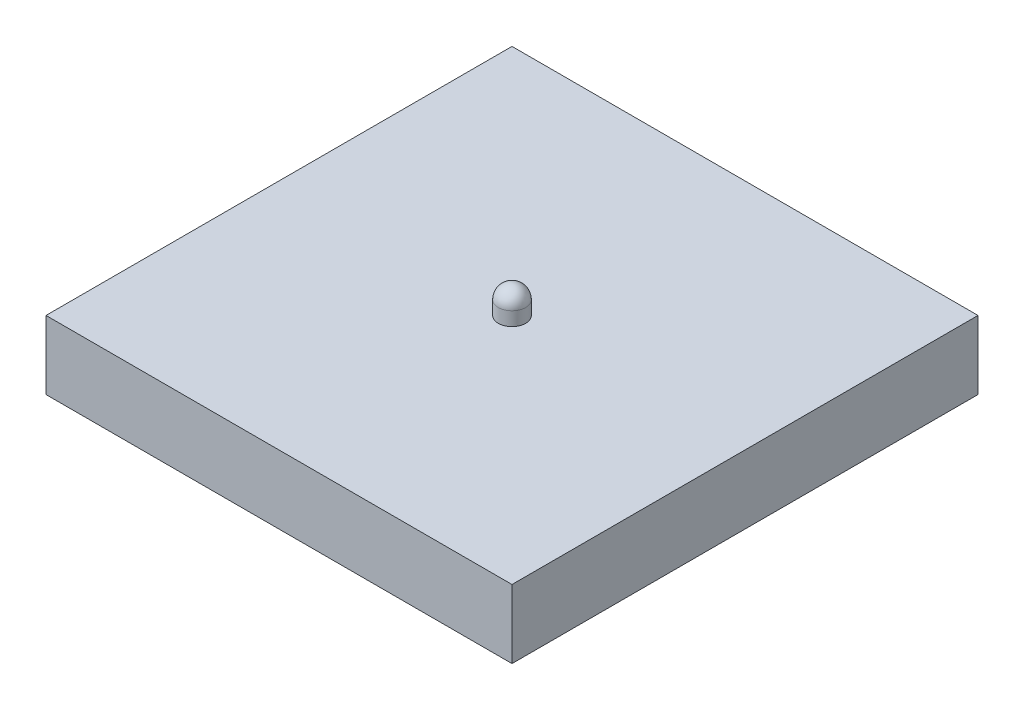
ISO-10303-21;
HEADER;
FILE_DESCRIPTION(('STEP AP214'),'2;1');
FILE_NAME('part.step','',(''),(''),'','','');
FILE_SCHEMA(('AUTOMOTIVE_DESIGN { 1 0 10303 214 1 1 1 1 }'));
ENDSEC;
DATA;
#1=APPLICATION_CONTEXT('core data for automotive mechanical design processes');
#2=APPLICATION_PROTOCOL_DEFINITION('international standard','automotive_design',2000,#1);
#3=PRODUCT_CONTEXT('',#1,'mechanical');
#4=PRODUCT('Part','Part','',(#3));
#5=PRODUCT_RELATED_PRODUCT_CATEGORY('part','',(#4));
#6=PRODUCT_DEFINITION_FORMATION('','',#4);
#7=PRODUCT_DEFINITION_CONTEXT('part definition',#1,'design');
#8=PRODUCT_DEFINITION('design','',#6,#7);
#9=PRODUCT_DEFINITION_SHAPE('','',#8);
#10=(LENGTH_UNIT() NAMED_UNIT(*) SI_UNIT(.MILLI.,.METRE.));
#11=(NAMED_UNIT(*) PLANE_ANGLE_UNIT() SI_UNIT($,.RADIAN.));
#12=(NAMED_UNIT(*) SI_UNIT($,.STERADIAN.) SOLID_ANGLE_UNIT());
#13=UNCERTAINTY_MEASURE_WITH_UNIT(LENGTH_MEASURE(1.E-05),#10,'distance_accuracy_value','');
#14=(GEOMETRIC_REPRESENTATION_CONTEXT(3) GLOBAL_UNCERTAINTY_ASSIGNED_CONTEXT((#13)) GLOBAL_UNIT_ASSIGNED_CONTEXT((#10,
#11,#12)) REPRESENTATION_CONTEXT('',''));
#15=CARTESIAN_POINT('',(0.,0.,0.));
#16=DIRECTION('',(0.,0.,1.));
#17=DIRECTION('',(1.,0.,0.));
#18=AXIS2_PLACEMENT_3D('',#15,#16,#17);
#19=CARTESIAN_POINT('',(17.,5.,17.));
#20=DIRECTION('',(-1.,0.,0.));
#21=DIRECTION('',(0.,0.,1.));
#22=AXIS2_PLACEMENT_3D('',#19,#20,#21);
#23=PLANE('',#22);
#24=DIRECTION('',(0.,0.,-1.));
#25=VECTOR('',#24,1.);
#26=CARTESIAN_POINT('',(17.,0.,17.));
#27=LINE('',#26,#25);
#28=CARTESIAN_POINT('',(17.,0.,17.));
#29=VERTEX_POINT('',#28);
#30=CARTESIAN_POINT('',(17.,0.,-17.));
#31=VERTEX_POINT('',#30);
#32=EDGE_CURVE('E143',#29,#31,#27,.T.);
#33=ORIENTED_EDGE('',*,*,#32,.T.);
#34=DIRECTION('',(0.,-1.,0.));
#35=VECTOR('',#34,1.);
#36=CARTESIAN_POINT('',(17.,5.,-17.));
#37=LINE('',#36,#35);
#38=CARTESIAN_POINT('',(17.,5.,-17.));
#39=VERTEX_POINT('',#38);
#40=EDGE_CURVE('E167',#39,#31,#37,.T.);
#41=ORIENTED_EDGE('',*,*,#40,.F.);
#42=DIRECTION('',(0.,0.,-1.));
#43=VECTOR('',#42,1.);
#44=CARTESIAN_POINT('',(17.,5.,17.));
#45=LINE('',#44,#43);
#46=CARTESIAN_POINT('',(17.,5.,17.));
#47=VERTEX_POINT('',#46);
#48=EDGE_CURVE('E147',#47,#39,#45,.T.);
#49=ORIENTED_EDGE('',*,*,#48,.F.);
#50=DIRECTION('',(0.,-1.,0.));
#51=VECTOR('',#50,1.);
#52=CARTESIAN_POINT('',(17.,5.,17.));
#53=LINE('',#52,#51);
#54=EDGE_CURVE('E153',#47,#29,#53,.T.);
#55=ORIENTED_EDGE('',*,*,#54,.T.);
#56=EDGE_LOOP('',(#33,#41,#49,#55));
#57=FACE_BOUND('',#56,.T.);
#58=ADVANCED_FACE('F33',(#57),#23,.F.);
#59=CARTESIAN_POINT('',(-17.,5.,-17.));
#60=DIRECTION('',(0.,0.,1.));
#61=DIRECTION('',(1.,0.,0.));
#62=AXIS2_PLACEMENT_3D('',#59,#60,#61);
#63=PLANE('',#62);
#64=DIRECTION('',(-1.,0.,0.));
#65=VECTOR('',#64,1.);
#66=CARTESIAN_POINT('',(-17.,0.,-17.));
#67=LINE('',#66,#65);
#68=CARTESIAN_POINT('',(-17.,0.,-17.));
#69=VERTEX_POINT('',#68);
#70=EDGE_CURVE('E156',#31,#69,#67,.T.);
#71=ORIENTED_EDGE('',*,*,#70,.T.);
#72=DIRECTION('',(0.,-1.,0.));
#73=VECTOR('',#72,1.);
#74=CARTESIAN_POINT('',(-17.,5.,-17.));
#75=LINE('',#74,#73);
#76=CARTESIAN_POINT('',(-17.,5.,-17.));
#77=VERTEX_POINT('',#76);
#78=EDGE_CURVE('E164',#77,#69,#75,.T.);
#79=ORIENTED_EDGE('',*,*,#78,.F.);
#80=DIRECTION('',(-1.,0.,0.));
#81=VECTOR('',#80,1.);
#82=CARTESIAN_POINT('',(-17.,5.,-17.));
#83=LINE('',#82,#81);
#84=EDGE_CURVE('E86',#39,#77,#83,.T.);
#85=ORIENTED_EDGE('',*,*,#84,.F.);
#86=ORIENTED_EDGE('',*,*,#40,.T.);
#87=EDGE_LOOP('',(#71,#79,#85,#86));
#88=FACE_BOUND('',#87,.T.);
#89=ADVANCED_FACE('F182',(#88),#63,.F.);
#90=CARTESIAN_POINT('',(-17.,5.,17.));
#91=DIRECTION('',(1.,0.,0.));
#92=DIRECTION('',(0.,0.,-1.));
#93=AXIS2_PLACEMENT_3D('',#90,#91,#92);
#94=PLANE('',#93);
#95=DIRECTION('',(0.,0.,1.));
#96=VECTOR('',#95,1.);
#97=CARTESIAN_POINT('',(-17.,0.,17.));
#98=LINE('',#97,#96);
#99=CARTESIAN_POINT('',(-17.,0.,17.));
#100=VERTEX_POINT('',#99);
#101=EDGE_CURVE('E158',#69,#100,#98,.T.);
#102=ORIENTED_EDGE('',*,*,#101,.T.);
#103=DIRECTION('',(0.,-1.,0.));
#104=VECTOR('',#103,1.);
#105=CARTESIAN_POINT('',(-17.,5.,17.));
#106=LINE('',#105,#104);
#107=CARTESIAN_POINT('',(-17.,5.,17.));
#108=VERTEX_POINT('',#107);
#109=EDGE_CURVE('E162',#108,#100,#106,.T.);
#110=ORIENTED_EDGE('',*,*,#109,.F.);
#111=DIRECTION('',(0.,0.,1.));
#112=VECTOR('',#111,1.);
#113=CARTESIAN_POINT('',(-17.,5.,17.));
#114=LINE('',#113,#112);
#115=EDGE_CURVE('E150',#77,#108,#114,.T.);
#116=ORIENTED_EDGE('',*,*,#115,.F.);
#117=ORIENTED_EDGE('',*,*,#78,.T.);
#118=EDGE_LOOP('',(#102,#110,#116,#117));
#119=FACE_BOUND('',#118,.T.);
#120=ADVANCED_FACE('F187',(#119),#94,.F.);
#121=CARTESIAN_POINT('',(-17.,5.,17.));
#122=DIRECTION('',(0.,0.,-1.));
#123=DIRECTION('',(-1.,0.,0.));
#124=AXIS2_PLACEMENT_3D('',#121,#122,#123);
#125=PLANE('',#124);
#126=DIRECTION('',(1.,0.,0.));
#127=VECTOR('',#126,1.);
#128=CARTESIAN_POINT('',(-17.,0.,17.));
#129=LINE('',#128,#127);
#130=EDGE_CURVE('E78',#100,#29,#129,.T.);
#131=ORIENTED_EDGE('',*,*,#130,.T.);
#132=ORIENTED_EDGE('',*,*,#54,.F.);
#133=DIRECTION('',(1.,0.,0.));
#134=VECTOR('',#133,1.);
#135=CARTESIAN_POINT('',(-17.,5.,17.));
#136=LINE('',#135,#134);
#137=EDGE_CURVE('E57',#108,#47,#136,.T.);
#138=ORIENTED_EDGE('',*,*,#137,.F.);
#139=ORIENTED_EDGE('',*,*,#109,.T.);
#140=EDGE_LOOP('',(#131,#132,#138,#139));
#141=FACE_BOUND('',#140,.T.);
#142=ADVANCED_FACE('F176',(#141),#125,.F.);
#143=CARTESIAN_POINT('',(0.,5.,0.));
#144=DIRECTION('',(0.,-1.,0.));
#145=DIRECTION('',(0.,0.,-1.));
#146=AXIS2_PLACEMENT_3D('',#143,#144,#145);
#147=PLANE('',#146);
#148=CARTESIAN_POINT('',(0.,5.,0.));
#149=DIRECTION('',(0.,-1.,0.));
#150=DIRECTION('',(0.,0.,-1.));
#151=AXIS2_PLACEMENT_3D('',#148,#149,#150);
#152=CIRCLE('',#151,1.);
#153=CARTESIAN_POINT('',(0.,5.,-1.));
#154=VERTEX_POINT('',#153);
#155=EDGE_CURVE('E41',#154,#154,#152,.F.);
#156=ORIENTED_EDGE('',*,*,#155,.F.);
#157=EDGE_LOOP('',(#156));
#158=FACE_BOUND('',#157,.T.);
#159=ORIENTED_EDGE('',*,*,#48,.T.);
#160=ORIENTED_EDGE('',*,*,#84,.T.);
#161=ORIENTED_EDGE('',*,*,#115,.T.);
#162=ORIENTED_EDGE('',*,*,#137,.T.);
#163=EDGE_LOOP('',(#159,#160,#161,#162));
#164=FACE_BOUND('',#163,.T.);
#165=ADVANCED_FACE('F173',(#158,#164),#147,.F.);
#166=CARTESIAN_POINT('',(0.,0.,0.));
#167=DIRECTION('',(0.,-1.,0.));
#168=DIRECTION('',(0.,0.,-1.));
#169=AXIS2_PLACEMENT_3D('',#166,#167,#168);
#170=PLANE('',#169);
#171=DIRECTION('',(0.,0.,1.));
#172=VECTOR('',#171,1.);
#173=CARTESIAN_POINT('',(16.,0.,-16.));
#174=LINE('',#173,#172);
#175=CARTESIAN_POINT('',(16.,0.,-16.));
#176=VERTEX_POINT('',#175);
#177=CARTESIAN_POINT('',(16.,0.,16.));
#178=VERTEX_POINT('',#177);
#179=EDGE_CURVE('E48',#176,#178,#174,.T.);
#180=ORIENTED_EDGE('',*,*,#179,.F.);
#181=DIRECTION('',(1.,0.,0.));
#182=VECTOR('',#181,1.);
#183=CARTESIAN_POINT('',(-16.,0.,-16.));
#184=LINE('',#183,#182);
#185=CARTESIAN_POINT('',(-16.,0.,-16.));
#186=VERTEX_POINT('',#185);
#187=EDGE_CURVE('E128',#186,#176,#184,.T.);
#188=ORIENTED_EDGE('',*,*,#187,.F.);
#189=DIRECTION('',(0.,0.,-1.));
#190=VECTOR('',#189,1.);
#191=CARTESIAN_POINT('',(-16.,0.,-16.));
#192=LINE('',#191,#190);
#193=CARTESIAN_POINT('',(-16.,0.,16.));
#194=VERTEX_POINT('',#193);
#195=EDGE_CURVE('E131',#194,#186,#192,.T.);
#196=ORIENTED_EDGE('',*,*,#195,.F.);
#197=DIRECTION('',(-1.,0.,0.));
#198=VECTOR('',#197,1.);
#199=CARTESIAN_POINT('',(-16.,0.,16.));
#200=LINE('',#199,#198);
#201=EDGE_CURVE('E137',#178,#194,#200,.T.);
#202=ORIENTED_EDGE('',*,*,#201,.F.);
#203=EDGE_LOOP('',(#180,#188,#196,#202));
#204=FACE_BOUND('',#203,.T.);
#205=ORIENTED_EDGE('',*,*,#32,.F.);
#206=ORIENTED_EDGE('',*,*,#130,.F.);
#207=ORIENTED_EDGE('',*,*,#101,.F.);
#208=ORIENTED_EDGE('',*,*,#70,.F.);
#209=EDGE_LOOP('',(#205,#206,#207,#208));
#210=FACE_BOUND('',#209,.T.);
#211=ADVANCED_FACE('F175',(#204,#210),#170,.T.);
#212=CARTESIAN_POINT('',(16.,3.,-16.));
#213=DIRECTION('',(1.,0.,0.));
#214=DIRECTION('',(0.,0.,-1.));
#215=AXIS2_PLACEMENT_3D('',#212,#213,#214);
#216=PLANE('',#215);
#217=ORIENTED_EDGE('',*,*,#179,.T.);
#218=DIRECTION('',(0.,-1.,0.));
#219=VECTOR('',#218,1.);
#220=CARTESIAN_POINT('',(16.,3.,16.));
#221=LINE('',#220,#219);
#222=CARTESIAN_POINT('',(16.,3.,16.));
#223=VERTEX_POINT('',#222);
#224=EDGE_CURVE('E106',#223,#178,#221,.T.);
#225=ORIENTED_EDGE('',*,*,#224,.F.);
#226=DIRECTION('',(0.,0.,1.));
#227=VECTOR('',#226,1.);
#228=CARTESIAN_POINT('',(16.,3.,-16.));
#229=LINE('',#228,#227);
#230=CARTESIAN_POINT('',(16.,3.,-16.));
#231=VERTEX_POINT('',#230);
#232=EDGE_CURVE('E110',#231,#223,#229,.T.);
#233=ORIENTED_EDGE('',*,*,#232,.F.);
#234=DIRECTION('',(0.,-1.,0.));
#235=VECTOR('',#234,1.);
#236=CARTESIAN_POINT('',(16.,3.,-16.));
#237=LINE('',#236,#235);
#238=EDGE_CURVE('E141',#231,#176,#237,.T.);
#239=ORIENTED_EDGE('',*,*,#238,.T.);
#240=EDGE_LOOP('',(#217,#225,#233,#239));
#241=FACE_BOUND('',#240,.T.);
#242=ADVANCED_FACE('F108',(#241),#216,.F.);
#243=CARTESIAN_POINT('',(-16.,3.,-16.));
#244=DIRECTION('',(0.,0.,-1.));
#245=DIRECTION('',(-1.,0.,0.));
#246=AXIS2_PLACEMENT_3D('',#243,#244,#245);
#247=PLANE('',#246);
#248=ORIENTED_EDGE('',*,*,#187,.T.);
#249=ORIENTED_EDGE('',*,*,#238,.F.);
#250=DIRECTION('',(1.,0.,0.));
#251=VECTOR('',#250,1.);
#252=CARTESIAN_POINT('',(-16.,3.,-16.));
#253=LINE('',#252,#251);
#254=CARTESIAN_POINT('',(-16.,3.,-16.));
#255=VERTEX_POINT('',#254);
#256=EDGE_CURVE('E116',#255,#231,#253,.T.);
#257=ORIENTED_EDGE('',*,*,#256,.F.);
#258=DIRECTION('',(0.,-1.,0.));
#259=VECTOR('',#258,1.);
#260=CARTESIAN_POINT('',(-16.,3.,-16.));
#261=LINE('',#260,#259);
#262=EDGE_CURVE('E144',#255,#186,#261,.T.);
#263=ORIENTED_EDGE('',*,*,#262,.T.);
#264=EDGE_LOOP('',(#248,#249,#257,#263));
#265=FACE_BOUND('',#264,.T.);
#266=ADVANCED_FACE('F195',(#265),#247,.F.);
#267=CARTESIAN_POINT('',(-16.,3.,-16.));
#268=DIRECTION('',(-1.,0.,0.));
#269=DIRECTION('',(0.,0.,1.));
#270=AXIS2_PLACEMENT_3D('',#267,#268,#269);
#271=PLANE('',#270);
#272=ORIENTED_EDGE('',*,*,#195,.T.);
#273=ORIENTED_EDGE('',*,*,#262,.F.);
#274=DIRECTION('',(0.,0.,-1.));
#275=VECTOR('',#274,1.);
#276=CARTESIAN_POINT('',(-16.,3.,-16.));
#277=LINE('',#276,#275);
#278=CARTESIAN_POINT('',(-16.,3.,16.));
#279=VERTEX_POINT('',#278);
#280=EDGE_CURVE('E124',#279,#255,#277,.T.);
#281=ORIENTED_EDGE('',*,*,#280,.F.);
#282=DIRECTION('',(0.,-1.,0.));
#283=VECTOR('',#282,1.);
#284=CARTESIAN_POINT('',(-16.,3.,16.));
#285=LINE('',#284,#283);
#286=EDGE_CURVE('E115',#279,#194,#285,.T.);
#287=ORIENTED_EDGE('',*,*,#286,.T.);
#288=EDGE_LOOP('',(#272,#273,#281,#287));
#289=FACE_BOUND('',#288,.T.);
#290=ADVANCED_FACE('F247',(#289),#271,.F.);
#291=CARTESIAN_POINT('',(-16.,3.,16.));
#292=DIRECTION('',(0.,0.,1.));
#293=DIRECTION('',(1.,0.,0.));
#294=AXIS2_PLACEMENT_3D('',#291,#292,#293);
#295=PLANE('',#294);
#296=ORIENTED_EDGE('',*,*,#201,.T.);
#297=ORIENTED_EDGE('',*,*,#286,.F.);
#298=DIRECTION('',(-1.,0.,0.));
#299=VECTOR('',#298,1.);
#300=CARTESIAN_POINT('',(-16.,3.,16.));
#301=LINE('',#300,#299);
#302=EDGE_CURVE('E119',#223,#279,#301,.T.);
#303=ORIENTED_EDGE('',*,*,#302,.F.);
#304=ORIENTED_EDGE('',*,*,#224,.T.);
#305=EDGE_LOOP('',(#296,#297,#303,#304));
#306=FACE_BOUND('',#305,.T.);
#307=ADVANCED_FACE('F120',(#306),#295,.F.);
#308=CARTESIAN_POINT('',(0.,3.,0.));
#309=DIRECTION('',(0.,1.,0.));
#310=DIRECTION('',(0.,0.,1.));
#311=AXIS2_PLACEMENT_3D('',#308,#309,#310);
#312=PLANE('',#311);
#313=ORIENTED_EDGE('',*,*,#232,.T.);
#314=ORIENTED_EDGE('',*,*,#302,.T.);
#315=ORIENTED_EDGE('',*,*,#280,.T.);
#316=ORIENTED_EDGE('',*,*,#256,.T.);
#317=EDGE_LOOP('',(#313,#314,#315,#316));
#318=FACE_BOUND('',#317,.T.);
#319=ADVANCED_FACE('F126',(#318),#312,.F.);
#320=CARTESIAN_POINT('',(0.,7.,0.));
#321=DIRECTION('',(0.,-1.,0.));
#322=DIRECTION('',(0.,0.,-1.));
#323=AXIS2_PLACEMENT_3D('',#320,#321,#322);
#324=CYLINDRICAL_SURFACE('',#323,1.);
#325=CARTESIAN_POINT('',(0.,6.,0.));
#326=DIRECTION('',(0.,-1.,0.));
#327=DIRECTION('',(0.,0.,-1.));
#328=AXIS2_PLACEMENT_3D('',#325,#326,#327);
#329=CIRCLE('',#328,1.);
#330=CARTESIAN_POINT('',(0.,6.,-1.));
#331=VERTEX_POINT('',#330);
#332=EDGE_CURVE('E11',#331,#331,#329,.T.);
#333=ORIENTED_EDGE('',*,*,#332,.T.);
#334=EDGE_LOOP('',(#333));
#335=FACE_BOUND('',#334,.T.);
#336=ORIENTED_EDGE('',*,*,#155,.T.);
#337=EDGE_LOOP('',(#336));
#338=FACE_BOUND('',#337,.T.);
#339=ADVANCED_FACE('F171',(#335,#338),#324,.T.);
#340=CARTESIAN_POINT('',(0.,6.,0.));
#341=DIRECTION('',(0.,1.,0.));
#342=DIRECTION('',(0.,0.,1.));
#343=AXIS2_PLACEMENT_3D('',#340,#341,#342);
#344=SPHERICAL_SURFACE('',#343,1.);
#345=ORIENTED_EDGE('',*,*,#332,.F.);
#346=EDGE_LOOP('',(#345));
#347=FACE_BOUND('',#346,.T.);
#348=ADVANCED_FACE('F35',(#347),#344,.T.);
#349=CLOSED_SHELL('',(#58,#89,#120,#142,#165,#211,#242,#266,#290,#307,#319,#339,#348));
#350=MANIFOLD_SOLID_BREP('B2',#349);
#351=ADVANCED_BREP_SHAPE_REPRESENTATION('',(#18,#350),#14);
#352=SHAPE_DEFINITION_REPRESENTATION(#9,#351);
ENDSEC;
END-ISO-10303-21;
